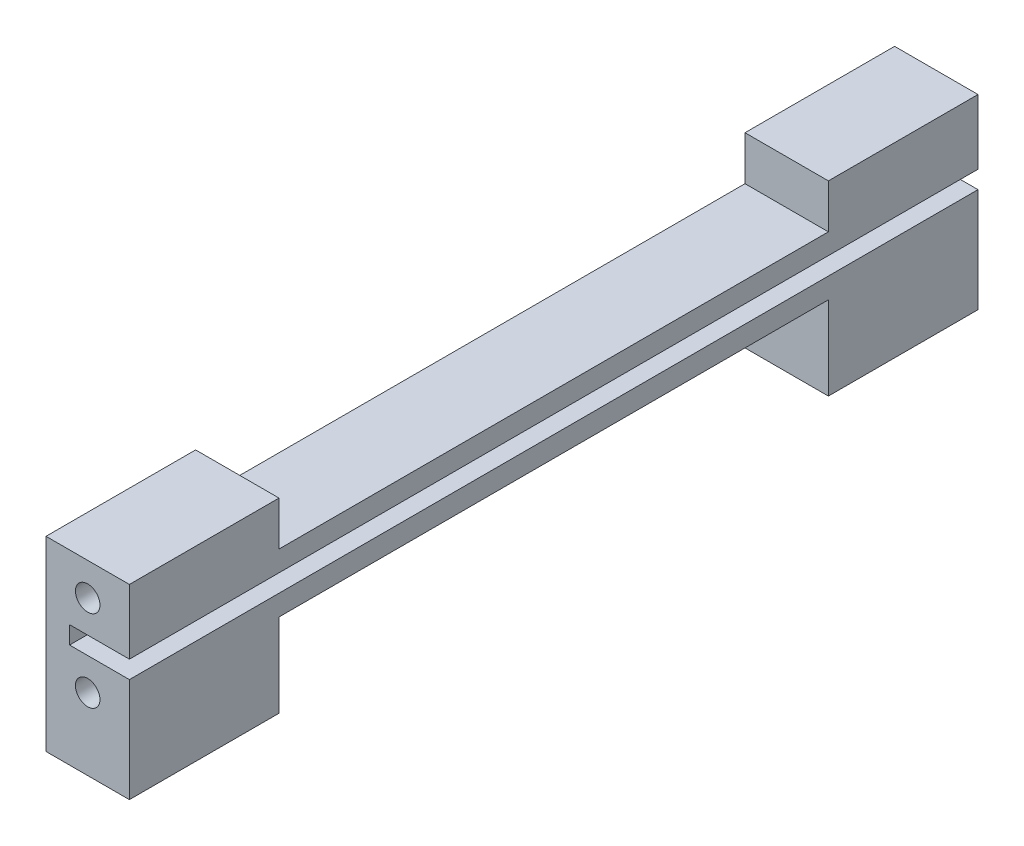
ISO-10303-21;
HEADER;
FILE_DESCRIPTION(('STEP AP214'),'2;1');
FILE_NAME('part.step','',(''),(''),'','','');
FILE_SCHEMA(('AUTOMOTIVE_DESIGN { 1 0 10303 214 1 1 1 1 }'));
ENDSEC;
DATA;
#1=APPLICATION_CONTEXT('core data for automotive mechanical design processes');
#2=APPLICATION_PROTOCOL_DEFINITION('international standard','automotive_design',2000,#1);
#3=PRODUCT_CONTEXT('',#1,'mechanical');
#4=PRODUCT('Part','Part','',(#3));
#5=PRODUCT_RELATED_PRODUCT_CATEGORY('part','',(#4));
#6=PRODUCT_DEFINITION_FORMATION('','',#4);
#7=PRODUCT_DEFINITION_CONTEXT('part definition',#1,'design');
#8=PRODUCT_DEFINITION('design','',#6,#7);
#9=PRODUCT_DEFINITION_SHAPE('','',#8);
#10=(LENGTH_UNIT() NAMED_UNIT(*) SI_UNIT(.MILLI.,.METRE.));
#11=(NAMED_UNIT(*) PLANE_ANGLE_UNIT() SI_UNIT($,.RADIAN.));
#12=(NAMED_UNIT(*) SI_UNIT($,.STERADIAN.) SOLID_ANGLE_UNIT());
#13=UNCERTAINTY_MEASURE_WITH_UNIT(LENGTH_MEASURE(1.E-05),#10,'distance_accuracy_value','');
#14=(GEOMETRIC_REPRESENTATION_CONTEXT(3) GLOBAL_UNCERTAINTY_ASSIGNED_CONTEXT((#13)) GLOBAL_UNIT_ASSIGNED_CONTEXT((#10,
#11,#12)) REPRESENTATION_CONTEXT('',''));
#15=CARTESIAN_POINT('',(0.,0.,0.));
#16=DIRECTION('',(0.,0.,1.));
#17=DIRECTION('',(1.,0.,0.));
#18=AXIS2_PLACEMENT_3D('',#15,#16,#17);
#19=CARTESIAN_POINT('',(8.5,0.,0.));
#20=DIRECTION('',(-1.,0.,0.));
#21=DIRECTION('',(0.,0.,1.));
#22=AXIS2_PLACEMENT_3D('',#19,#20,#21);
#23=PLANE('',#22);
#24=DIRECTION('',(0.,0.,-1.));
#25=VECTOR('',#24,1.);
#26=CARTESIAN_POINT('',(8.5,6.6,0.));
#27=LINE('',#26,#25);
#28=CARTESIAN_POINT('',(8.5,6.6,0.));
#29=VERTEX_POINT('',#28);
#30=CARTESIAN_POINT('',(8.5,6.6,-86.5));
#31=VERTEX_POINT('',#30);
#32=EDGE_CURVE('E322',#29,#31,#27,.T.);
#33=ORIENTED_EDGE('',*,*,#32,.F.);
#34=DIRECTION('',(0.,-1.,0.));
#35=VECTOR('',#34,1.);
#36=CARTESIAN_POINT('',(8.5,15.,0.));
#37=LINE('',#36,#35);
#38=CARTESIAN_POINT('',(8.5,-4.,0.));
#39=VERTEX_POINT('',#38);
#40=EDGE_CURVE('E240',#29,#39,#37,.T.);
#41=ORIENTED_EDGE('',*,*,#40,.T.);
#42=DIRECTION('',(0.,0.,1.));
#43=VECTOR('',#42,1.);
#44=CARTESIAN_POINT('',(8.5,-4.,0.));
#45=LINE('',#44,#43);
#46=CARTESIAN_POINT('',(8.5,-4.,-15.25));
#47=VERTEX_POINT('',#46);
#48=EDGE_CURVE('E289',#47,#39,#45,.T.);
#49=ORIENTED_EDGE('',*,*,#48,.F.);
#50=DIRECTION('',(0.,1.,0.));
#51=VECTOR('',#50,1.);
#52=CARTESIAN_POINT('',(8.5,0.,-15.25));
#53=LINE('',#52,#51);
#54=CARTESIAN_POINT('',(8.5,4.5,-15.25));
#55=VERTEX_POINT('',#54);
#56=EDGE_CURVE('E127',#47,#55,#53,.T.);
#57=ORIENTED_EDGE('',*,*,#56,.T.);
#58=DIRECTION('',(0.,0.,-1.));
#59=VECTOR('',#58,1.);
#60=CARTESIAN_POINT('',(8.5,4.5,-15.25));
#61=LINE('',#60,#59);
#62=CARTESIAN_POINT('',(8.5,4.5,-71.25));
#63=VERTEX_POINT('',#62);
#64=EDGE_CURVE('E117',#55,#63,#61,.T.);
#65=ORIENTED_EDGE('',*,*,#64,.T.);
#66=DIRECTION('',(0.,-1.,0.));
#67=VECTOR('',#66,1.);
#68=CARTESIAN_POINT('',(8.5,4.5,-71.25));
#69=LINE('',#68,#67);
#70=CARTESIAN_POINT('',(8.5,-4.,-71.25));
#71=VERTEX_POINT('',#70);
#72=EDGE_CURVE('E123',#63,#71,#69,.T.);
#73=ORIENTED_EDGE('',*,*,#72,.T.);
#74=DIRECTION('',(0.,0.,1.));
#75=VECTOR('',#74,1.);
#76=CARTESIAN_POINT('',(8.5,-4.,-86.5));
#77=LINE('',#76,#75);
#78=CARTESIAN_POINT('',(8.5,-4.,-86.5));
#79=VERTEX_POINT('',#78);
#80=EDGE_CURVE('E303',#79,#71,#77,.T.);
#81=ORIENTED_EDGE('',*,*,#80,.F.);
#82=DIRECTION('',(0.,1.,0.));
#83=VECTOR('',#82,1.);
#84=CARTESIAN_POINT('',(8.5,0.,-86.5));
#85=LINE('',#84,#83);
#86=EDGE_CURVE('E153',#79,#31,#85,.T.);
#87=ORIENTED_EDGE('',*,*,#86,.T.);
#88=EDGE_LOOP('',(#33,#41,#49,#57,#65,#73,#81,#87));
#89=FACE_BOUND('',#88,.T.);
#90=ADVANCED_FACE('F38',(#89),#23,.F.);
#91=CARTESIAN_POINT('',(8.5,15.,0.));
#92=DIRECTION('',(0.,0.,-1.));
#93=DIRECTION('',(0.,1.,0.));
#94=AXIS2_PLACEMENT_3D('',#91,#92,#93);
#95=PLANE('',#94);
#96=DIRECTION('',(0.,-1.,0.));
#97=VECTOR('',#96,1.);
#98=CARTESIAN_POINT('',(2.4,8.35,0.));
#99=LINE('',#98,#97);
#100=CARTESIAN_POINT('',(2.4,8.4,0.));
#101=VERTEX_POINT('',#100);
#102=CARTESIAN_POINT('',(2.4,6.6,0.));
#103=VERTEX_POINT('',#102);
#104=EDGE_CURVE('E330',#101,#103,#99,.T.);
#105=ORIENTED_EDGE('',*,*,#104,.F.);
#106=DIRECTION('',(-1.,0.,0.));
#107=VECTOR('',#106,1.);
#108=CARTESIAN_POINT('',(8.5,8.4,0.));
#109=LINE('',#108,#107);
#110=CARTESIAN_POINT('',(8.5,8.4,0.));
#111=VERTEX_POINT('',#110);
#112=EDGE_CURVE('E237',#111,#101,#109,.T.);
#113=ORIENTED_EDGE('',*,*,#112,.F.);
#114=CARTESIAN_POINT('',(8.5,15.,0.));
#115=VERTEX_POINT('',#114);
#116=EDGE_CURVE('E234',#115,#111,#37,.T.);
#117=ORIENTED_EDGE('',*,*,#116,.F.);
#118=DIRECTION('',(-1.,0.,0.));
#119=VECTOR('',#118,1.);
#120=CARTESIAN_POINT('',(8.5,15.,0.));
#121=LINE('',#120,#119);
#122=CARTESIAN_POINT('',(0.,15.,0.));
#123=VERTEX_POINT('',#122);
#124=EDGE_CURVE('E199',#115,#123,#121,.T.);
#125=ORIENTED_EDGE('',*,*,#124,.T.);
#126=DIRECTION('',(0.,-1.,0.));
#127=VECTOR('',#126,1.);
#128=CARTESIAN_POINT('',(0.,15.,0.));
#129=LINE('',#128,#127);
#130=CARTESIAN_POINT('',(0.,-4.,0.));
#131=VERTEX_POINT('',#130);
#132=EDGE_CURVE('E176',#123,#131,#129,.T.);
#133=ORIENTED_EDGE('',*,*,#132,.T.);
#134=DIRECTION('',(-1.,0.,0.));
#135=VECTOR('',#134,1.);
#136=CARTESIAN_POINT('',(0.,-4.,0.));
#137=LINE('',#136,#135);
#138=EDGE_CURVE('E286',#39,#131,#137,.T.);
#139=ORIENTED_EDGE('',*,*,#138,.F.);
#140=ORIENTED_EDGE('',*,*,#40,.F.);
#141=DIRECTION('',(1.,0.,0.));
#142=VECTOR('',#141,1.);
#143=CARTESIAN_POINT('',(8.5,6.6,0.));
#144=LINE('',#143,#142);
#145=EDGE_CURVE('E314',#103,#29,#144,.T.);
#146=ORIENTED_EDGE('',*,*,#145,.F.);
#147=EDGE_LOOP('',(#105,#113,#117,#125,#133,#139,#140,#146));
#148=FACE_BOUND('',#147,.T.);
#149=CARTESIAN_POINT('',(4.25,3.325,0.));
#150=DIRECTION('',(0.,0.,1.));
#151=DIRECTION('',(1.,0.,0.));
#152=AXIS2_PLACEMENT_3D('',#149,#150,#151);
#153=CIRCLE('',#152,1.24999999999999);
#154=CARTESIAN_POINT('',(5.49999999999999,3.325,0.));
#155=VERTEX_POINT('',#154);
#156=EDGE_CURVE('E266',#155,#155,#153,.T.);
#157=ORIENTED_EDGE('',*,*,#156,.F.);
#158=EDGE_LOOP('',(#157));
#159=FACE_BOUND('',#158,.T.);
#160=CARTESIAN_POINT('',(4.25,11.675,0.));
#161=DIRECTION('',(0.,0.,1.));
#162=DIRECTION('',(1.,0.,0.));
#163=AXIS2_PLACEMENT_3D('',#160,#161,#162);
#164=CIRCLE('',#163,1.24999999999999);
#165=CARTESIAN_POINT('',(5.49999999999999,11.675,0.));
#166=VERTEX_POINT('',#165);
#167=EDGE_CURVE('E258',#166,#166,#164,.T.);
#168=ORIENTED_EDGE('',*,*,#167,.F.);
#169=EDGE_LOOP('',(#168));
#170=FACE_BOUND('',#169,.T.);
#171=ADVANCED_FACE('F227',(#148,#159,#170),#95,.F.);
#172=CARTESIAN_POINT('',(8.5,0.,-86.5));
#173=DIRECTION('',(0.,0.,1.));
#174=DIRECTION('',(0.,-1.,0.));
#175=AXIS2_PLACEMENT_3D('',#172,#173,#174);
#176=PLANE('',#175);
#177=CARTESIAN_POINT('',(4.25,3.32499999999998,-86.5));
#178=DIRECTION('',(0.,0.,-1.));
#179=DIRECTION('',(0.,1.,0.));
#180=AXIS2_PLACEMENT_3D('',#177,#178,#179);
#181=CIRCLE('',#180,1.24999999999999);
#182=CARTESIAN_POINT('',(4.25,4.57499999999997,-86.5));
#183=VERTEX_POINT('',#182);
#184=EDGE_CURVE('E282',#183,#183,#181,.T.);
#185=ORIENTED_EDGE('',*,*,#184,.F.);
#186=EDGE_LOOP('',(#185));
#187=FACE_BOUND('',#186,.T.);
#188=CARTESIAN_POINT('',(4.25,11.675,-86.5));
#189=DIRECTION('',(0.,0.,-1.));
#190=DIRECTION('',(0.,1.,0.));
#191=AXIS2_PLACEMENT_3D('',#188,#189,#190);
#192=CIRCLE('',#191,1.24999999999999);
#193=CARTESIAN_POINT('',(4.25,12.925,-86.5));
#194=VERTEX_POINT('',#193);
#195=EDGE_CURVE('E274',#194,#194,#192,.T.);
#196=ORIENTED_EDGE('',*,*,#195,.F.);
#197=EDGE_LOOP('',(#196));
#198=FACE_BOUND('',#197,.T.);
#199=DIRECTION('',(1.,0.,0.));
#200=VECTOR('',#199,1.);
#201=CARTESIAN_POINT('',(8.5,8.4,-86.5));
#202=LINE('',#201,#200);
#203=CARTESIAN_POINT('',(2.4,8.4,-86.5));
#204=VERTEX_POINT('',#203);
#205=CARTESIAN_POINT('',(8.5,8.4,-86.5));
#206=VERTEX_POINT('',#205);
#207=EDGE_CURVE('E338',#204,#206,#202,.T.);
#208=ORIENTED_EDGE('',*,*,#207,.F.);
#209=DIRECTION('',(0.,1.,0.));
#210=VECTOR('',#209,1.);
#211=CARTESIAN_POINT('',(2.4,8.35,-86.5));
#212=LINE('',#211,#210);
#213=CARTESIAN_POINT('',(2.4,6.6,-86.5));
#214=VERTEX_POINT('',#213);
#215=EDGE_CURVE('E334',#214,#204,#212,.T.);
#216=ORIENTED_EDGE('',*,*,#215,.F.);
#217=DIRECTION('',(-1.,0.,0.));
#218=VECTOR('',#217,1.);
#219=CARTESIAN_POINT('',(8.5,6.6,-86.5));
#220=LINE('',#219,#218);
#221=EDGE_CURVE('E318',#31,#214,#220,.T.);
#222=ORIENTED_EDGE('',*,*,#221,.F.);
#223=ORIENTED_EDGE('',*,*,#86,.F.);
#224=DIRECTION('',(1.,0.,0.));
#225=VECTOR('',#224,1.);
#226=CARTESIAN_POINT('',(0.,-4.,-86.5));
#227=LINE('',#226,#225);
#228=CARTESIAN_POINT('',(0.,-4.,-86.5));
#229=VERTEX_POINT('',#228);
#230=EDGE_CURVE('E306',#229,#79,#227,.T.);
#231=ORIENTED_EDGE('',*,*,#230,.F.);
#232=DIRECTION('',(0.,1.,0.));
#233=VECTOR('',#232,1.);
#234=CARTESIAN_POINT('',(0.,0.,-86.5));
#235=LINE('',#234,#233);
#236=CARTESIAN_POINT('',(0.,15.,-86.5));
#237=VERTEX_POINT('',#236);
#238=EDGE_CURVE('E86',#229,#237,#235,.T.);
#239=ORIENTED_EDGE('',*,*,#238,.T.);
#240=DIRECTION('',(-1.,0.,0.));
#241=VECTOR('',#240,1.);
#242=CARTESIAN_POINT('',(8.5,15.,-86.5));
#243=LINE('',#242,#241);
#244=CARTESIAN_POINT('',(8.5,15.,-86.5));
#245=VERTEX_POINT('',#244);
#246=EDGE_CURVE('E143',#245,#237,#243,.T.);
#247=ORIENTED_EDGE('',*,*,#246,.F.);
#248=EDGE_CURVE('E150',#206,#245,#85,.T.);
#249=ORIENTED_EDGE('',*,*,#248,.F.);
#250=EDGE_LOOP('',(#208,#216,#222,#223,#231,#239,#247,#249));
#251=FACE_BOUND('',#250,.T.);
#252=ADVANCED_FACE('F362',(#187,#198,#251),#176,.F.);
#253=ORIENTED_EDGE('',*,*,#116,.T.);
#254=DIRECTION('',(0.,0.,1.));
#255=VECTOR('',#254,1.);
#256=CARTESIAN_POINT('',(8.5,8.4,0.));
#257=LINE('',#256,#255);
#258=EDGE_CURVE('E348',#206,#111,#257,.T.);
#259=ORIENTED_EDGE('',*,*,#258,.F.);
#260=ORIENTED_EDGE('',*,*,#248,.T.);
#261=DIRECTION('',(0.,0.,1.));
#262=VECTOR('',#261,1.);
#263=CARTESIAN_POINT('',(8.5,15.,-86.5));
#264=LINE('',#263,#262);
#265=CARTESIAN_POINT('',(8.5,15.,-71.25));
#266=VERTEX_POINT('',#265);
#267=EDGE_CURVE('E56',#245,#266,#264,.T.);
#268=ORIENTED_EDGE('',*,*,#267,.T.);
#269=DIRECTION('',(0.,-1.,0.));
#270=VECTOR('',#269,1.);
#271=CARTESIAN_POINT('',(8.5,15.,-71.25));
#272=LINE('',#271,#270);
#273=CARTESIAN_POINT('',(8.5,10.5,-71.25));
#274=VERTEX_POINT('',#273);
#275=EDGE_CURVE('E192',#266,#274,#272,.T.);
#276=ORIENTED_EDGE('',*,*,#275,.T.);
#277=DIRECTION('',(0.,0.,1.));
#278=VECTOR('',#277,1.);
#279=CARTESIAN_POINT('',(8.5,10.5,-71.25));
#280=LINE('',#279,#278);
#281=CARTESIAN_POINT('',(8.5,10.5,-15.25));
#282=VERTEX_POINT('',#281);
#283=EDGE_CURVE('E100',#274,#282,#280,.T.);
#284=ORIENTED_EDGE('',*,*,#283,.T.);
#285=DIRECTION('',(0.,1.,0.));
#286=VECTOR('',#285,1.);
#287=CARTESIAN_POINT('',(8.5,10.5,-15.25));
#288=LINE('',#287,#286);
#289=CARTESIAN_POINT('',(8.5,15.,-15.25));
#290=VERTEX_POINT('',#289);
#291=EDGE_CURVE('E213',#282,#290,#288,.T.);
#292=ORIENTED_EDGE('',*,*,#291,.T.);
#293=DIRECTION('',(0.,0.,1.));
#294=VECTOR('',#293,1.);
#295=CARTESIAN_POINT('',(8.5,15.,-15.25));
#296=LINE('',#295,#294);
#297=EDGE_CURVE('E245',#290,#115,#296,.T.);
#298=ORIENTED_EDGE('',*,*,#297,.T.);
#299=EDGE_LOOP('',(#253,#259,#260,#268,#276,#284,#292,#298));
#300=FACE_BOUND('',#299,.T.);
#301=ADVANCED_FACE('F358',(#300),#23,.F.);
#302=CARTESIAN_POINT('',(8.5,15.,-71.25));
#303=DIRECTION('',(0.,0.,-1.));
#304=DIRECTION('',(-1.,0.,0.));
#305=AXIS2_PLACEMENT_3D('',#302,#303,#304);
#306=PLANE('',#305);
#307=DIRECTION('',(0.,-1.,0.));
#308=VECTOR('',#307,1.);
#309=CARTESIAN_POINT('',(0.,15.,-71.25));
#310=LINE('',#309,#308);
#311=CARTESIAN_POINT('',(0.,15.,-71.25));
#312=VERTEX_POINT('',#311);
#313=CARTESIAN_POINT('',(0.,10.5,-71.25));
#314=VERTEX_POINT('',#313);
#315=EDGE_CURVE('E162',#312,#314,#310,.T.);
#316=ORIENTED_EDGE('',*,*,#315,.T.);
#317=DIRECTION('',(-1.,0.,0.));
#318=VECTOR('',#317,1.);
#319=CARTESIAN_POINT('',(8.5,10.5,-71.25));
#320=LINE('',#319,#318);
#321=EDGE_CURVE('E11',#274,#314,#320,.T.);
#322=ORIENTED_EDGE('',*,*,#321,.F.);
#323=ORIENTED_EDGE('',*,*,#275,.F.);
#324=DIRECTION('',(-1.,0.,0.));
#325=VECTOR('',#324,1.);
#326=CARTESIAN_POINT('',(8.5,15.,-71.25));
#327=LINE('',#326,#325);
#328=EDGE_CURVE('E161',#266,#312,#327,.T.);
#329=ORIENTED_EDGE('',*,*,#328,.T.);
#330=EDGE_LOOP('',(#316,#322,#323,#329));
#331=FACE_BOUND('',#330,.T.);
#332=ADVANCED_FACE('F40',(#331),#306,.F.);
#333=CARTESIAN_POINT('',(8.5,10.5,-71.25));
#334=DIRECTION('',(0.,-1.,0.));
#335=DIRECTION('',(0.,0.,-1.));
#336=AXIS2_PLACEMENT_3D('',#333,#334,#335);
#337=PLANE('',#336);
#338=DIRECTION('',(0.,0.,1.));
#339=VECTOR('',#338,1.);
#340=CARTESIAN_POINT('',(0.,10.5,-71.25));
#341=LINE('',#340,#339);
#342=CARTESIAN_POINT('',(0.,10.5,-15.25));
#343=VERTEX_POINT('',#342);
#344=EDGE_CURVE('E166',#314,#343,#341,.T.);
#345=ORIENTED_EDGE('',*,*,#344,.T.);
#346=DIRECTION('',(-1.,0.,0.));
#347=VECTOR('',#346,1.);
#348=CARTESIAN_POINT('',(8.5,10.5,-15.25));
#349=LINE('',#348,#347);
#350=EDGE_CURVE('E48',#282,#343,#349,.T.);
#351=ORIENTED_EDGE('',*,*,#350,.F.);
#352=ORIENTED_EDGE('',*,*,#283,.F.);
#353=ORIENTED_EDGE('',*,*,#321,.T.);
#354=EDGE_LOOP('',(#345,#351,#352,#353));
#355=FACE_BOUND('',#354,.T.);
#356=ADVANCED_FACE('F368',(#355),#337,.F.);
#357=CARTESIAN_POINT('',(8.5,10.5,-15.25));
#358=DIRECTION('',(0.,0.,1.));
#359=DIRECTION('',(0.,-1.,0.));
#360=AXIS2_PLACEMENT_3D('',#357,#358,#359);
#361=PLANE('',#360);
#362=DIRECTION('',(0.,1.,0.));
#363=VECTOR('',#362,1.);
#364=CARTESIAN_POINT('',(0.,10.5,-15.25));
#365=LINE('',#364,#363);
#366=CARTESIAN_POINT('',(0.,15.,-15.25));
#367=VERTEX_POINT('',#366);
#368=EDGE_CURVE('E170',#343,#367,#365,.T.);
#369=ORIENTED_EDGE('',*,*,#368,.T.);
#370=DIRECTION('',(-1.,0.,0.));
#371=VECTOR('',#370,1.);
#372=CARTESIAN_POINT('',(8.5,15.,-15.25));
#373=LINE('',#372,#371);
#374=EDGE_CURVE('E203',#290,#367,#373,.T.);
#375=ORIENTED_EDGE('',*,*,#374,.F.);
#376=ORIENTED_EDGE('',*,*,#291,.F.);
#377=ORIENTED_EDGE('',*,*,#350,.T.);
#378=EDGE_LOOP('',(#369,#375,#376,#377));
#379=FACE_BOUND('',#378,.T.);
#380=ADVANCED_FACE('F211',(#379),#361,.F.);
#381=CARTESIAN_POINT('',(8.5,15.,-15.25));
#382=DIRECTION('',(0.,-1.,0.));
#383=DIRECTION('',(0.,0.,-1.));
#384=AXIS2_PLACEMENT_3D('',#381,#382,#383);
#385=PLANE('',#384);
#386=DIRECTION('',(0.,0.,1.));
#387=VECTOR('',#386,1.);
#388=CARTESIAN_POINT('',(0.,15.,-15.25));
#389=LINE('',#388,#387);
#390=EDGE_CURVE('E173',#367,#123,#389,.T.);
#391=ORIENTED_EDGE('',*,*,#390,.T.);
#392=ORIENTED_EDGE('',*,*,#124,.F.);
#393=ORIENTED_EDGE('',*,*,#297,.F.);
#394=ORIENTED_EDGE('',*,*,#374,.T.);
#395=EDGE_LOOP('',(#391,#392,#393,#394));
#396=FACE_BOUND('',#395,.T.);
#397=ADVANCED_FACE('F222',(#396),#385,.F.);
#398=CARTESIAN_POINT('',(8.5,0.,-15.25));
#399=DIRECTION('',(0.,0.,1.));
#400=DIRECTION('',(1.,0.,0.));
#401=AXIS2_PLACEMENT_3D('',#398,#399,#400);
#402=PLANE('',#401);
#403=DIRECTION('',(0.,1.,0.));
#404=VECTOR('',#403,1.);
#405=CARTESIAN_POINT('',(0.,0.,-15.25));
#406=LINE('',#405,#404);
#407=CARTESIAN_POINT('',(0.,-4.,-15.25));
#408=VERTEX_POINT('',#407);
#409=CARTESIAN_POINT('',(0.,4.5,-15.25));
#410=VERTEX_POINT('',#409);
#411=EDGE_CURVE('E180',#408,#410,#406,.T.);
#412=ORIENTED_EDGE('',*,*,#411,.T.);
#413=DIRECTION('',(-1.,0.,0.));
#414=VECTOR('',#413,1.);
#415=CARTESIAN_POINT('',(8.5,4.5,-15.25));
#416=LINE('',#415,#414);
#417=EDGE_CURVE('E142',#55,#410,#416,.T.);
#418=ORIENTED_EDGE('',*,*,#417,.F.);
#419=ORIENTED_EDGE('',*,*,#56,.F.);
#420=DIRECTION('',(1.,0.,0.));
#421=VECTOR('',#420,1.);
#422=CARTESIAN_POINT('',(0.,-4.,-15.25));
#423=LINE('',#422,#421);
#424=EDGE_CURVE('E293',#408,#47,#423,.T.);
#425=ORIENTED_EDGE('',*,*,#424,.F.);
#426=EDGE_LOOP('',(#412,#418,#419,#425));
#427=FACE_BOUND('',#426,.T.);
#428=ADVANCED_FACE('F402',(#427),#402,.F.);
#429=CARTESIAN_POINT('',(8.5,4.5,-15.25));
#430=DIRECTION('',(0.,1.,0.));
#431=DIRECTION('',(0.,0.,1.));
#432=AXIS2_PLACEMENT_3D('',#429,#430,#431);
#433=PLANE('',#432);
#434=DIRECTION('',(0.,0.,-1.));
#435=VECTOR('',#434,1.);
#436=CARTESIAN_POINT('',(0.,4.5,-15.25));
#437=LINE('',#436,#435);
#438=CARTESIAN_POINT('',(0.,4.5,-71.25));
#439=VERTEX_POINT('',#438);
#440=EDGE_CURVE('E137',#410,#439,#437,.T.);
#441=ORIENTED_EDGE('',*,*,#440,.T.);
#442=DIRECTION('',(-1.,0.,0.));
#443=VECTOR('',#442,1.);
#444=CARTESIAN_POINT('',(8.5,4.5,-71.25));
#445=LINE('',#444,#443);
#446=EDGE_CURVE('E134',#63,#439,#445,.T.);
#447=ORIENTED_EDGE('',*,*,#446,.F.);
#448=ORIENTED_EDGE('',*,*,#64,.F.);
#449=ORIENTED_EDGE('',*,*,#417,.T.);
#450=EDGE_LOOP('',(#441,#447,#448,#449));
#451=FACE_BOUND('',#450,.T.);
#452=ADVANCED_FACE('F135',(#451),#433,.F.);
#453=CARTESIAN_POINT('',(8.5,4.5,-71.25));
#454=DIRECTION('',(0.,0.,-1.));
#455=DIRECTION('',(-1.,0.,0.));
#456=AXIS2_PLACEMENT_3D('',#453,#454,#455);
#457=PLANE('',#456);
#458=DIRECTION('',(0.,-1.,0.));
#459=VECTOR('',#458,1.);
#460=CARTESIAN_POINT('',(0.,4.5,-71.25));
#461=LINE('',#460,#459);
#462=CARTESIAN_POINT('',(0.,-4.,-71.25));
#463=VERTEX_POINT('',#462);
#464=EDGE_CURVE('E185',#439,#463,#461,.T.);
#465=ORIENTED_EDGE('',*,*,#464,.T.);
#466=DIRECTION('',(-1.,0.,0.));
#467=VECTOR('',#466,1.);
#468=CARTESIAN_POINT('',(0.,-4.,-71.25));
#469=LINE('',#468,#467);
#470=EDGE_CURVE('E148',#71,#463,#469,.T.);
#471=ORIENTED_EDGE('',*,*,#470,.F.);
#472=ORIENTED_EDGE('',*,*,#72,.F.);
#473=ORIENTED_EDGE('',*,*,#446,.T.);
#474=EDGE_LOOP('',(#465,#471,#472,#473));
#475=FACE_BOUND('',#474,.T.);
#476=ADVANCED_FACE('F146',(#475),#457,.F.);
#477=CARTESIAN_POINT('',(8.5,15.,-86.5));
#478=DIRECTION('',(0.,-1.,0.));
#479=DIRECTION('',(0.,0.,-1.));
#480=AXIS2_PLACEMENT_3D('',#477,#478,#479);
#481=PLANE('',#480);
#482=DIRECTION('',(0.,0.,1.));
#483=VECTOR('',#482,1.);
#484=CARTESIAN_POINT('',(0.,15.,-86.5));
#485=LINE('',#484,#483);
#486=EDGE_CURVE('E92',#237,#312,#485,.T.);
#487=ORIENTED_EDGE('',*,*,#486,.T.);
#488=ORIENTED_EDGE('',*,*,#328,.F.);
#489=ORIENTED_EDGE('',*,*,#267,.F.);
#490=ORIENTED_EDGE('',*,*,#246,.T.);
#491=EDGE_LOOP('',(#487,#488,#489,#490));
#492=FACE_BOUND('',#491,.T.);
#493=ADVANCED_FACE('F364',(#492),#481,.F.);
#494=CARTESIAN_POINT('',(0.,0.,0.));
#495=DIRECTION('',(-1.,0.,0.));
#496=DIRECTION('',(0.,0.,1.));
#497=AXIS2_PLACEMENT_3D('',#494,#495,#496);
#498=PLANE('',#497);
#499=ORIENTED_EDGE('',*,*,#315,.F.);
#500=ORIENTED_EDGE('',*,*,#486,.F.);
#501=ORIENTED_EDGE('',*,*,#238,.F.);
#502=DIRECTION('',(0.,0.,-1.));
#503=VECTOR('',#502,1.);
#504=CARTESIAN_POINT('',(0.,-4.,-86.5));
#505=LINE('',#504,#503);
#506=EDGE_CURVE('E310',#463,#229,#505,.T.);
#507=ORIENTED_EDGE('',*,*,#506,.F.);
#508=ORIENTED_EDGE('',*,*,#464,.F.);
#509=ORIENTED_EDGE('',*,*,#440,.F.);
#510=ORIENTED_EDGE('',*,*,#411,.F.);
#511=DIRECTION('',(0.,0.,-1.));
#512=VECTOR('',#511,1.);
#513=CARTESIAN_POINT('',(0.,-4.,0.));
#514=LINE('',#513,#512);
#515=EDGE_CURVE('E297',#131,#408,#514,.T.);
#516=ORIENTED_EDGE('',*,*,#515,.F.);
#517=ORIENTED_EDGE('',*,*,#132,.F.);
#518=ORIENTED_EDGE('',*,*,#390,.F.);
#519=ORIENTED_EDGE('',*,*,#368,.F.);
#520=ORIENTED_EDGE('',*,*,#344,.F.);
#521=EDGE_LOOP('',(#499,#500,#501,#507,#508,#509,#510,#516,#517,#518,#519,#520));
#522=FACE_BOUND('',#521,.T.);
#523=ADVANCED_FACE('F217',(#522),#498,.T.);
#524=CARTESIAN_POINT('',(4.25,11.675,-6.));
#525=DIRECTION('',(0.,0.,1.));
#526=DIRECTION('',(1.,0.,0.));
#527=AXIS2_PLACEMENT_3D('',#524,#525,#526);
#528=CONICAL_SURFACE('',#527,1.25,1.02974425867665);
#529=CARTESIAN_POINT('',(4.25,11.675,-6.75107577378445));
#530=VERTEX_POINT('',#529);
#531=VERTEX_LOOP('',#530);
#532=FACE_BOUND('',#531,.T.);
#533=CARTESIAN_POINT('',(4.25,11.675,-6.));
#534=DIRECTION('',(0.,0.,1.));
#535=DIRECTION('',(1.,0.,0.));
#536=AXIS2_PLACEMENT_3D('',#533,#534,#535);
#537=CIRCLE('',#536,1.25);
#538=CARTESIAN_POINT('',(5.5,11.675,-6.));
#539=VERTEX_POINT('',#538);
#540=EDGE_CURVE('E167',#539,#539,#537,.T.);
#541=ORIENTED_EDGE('',*,*,#540,.T.);
#542=EDGE_LOOP('',(#541));
#543=FACE_BOUND('',#542,.T.);
#544=ADVANCED_FACE('F424',(#532,#543),#528,.F.);
#545=CARTESIAN_POINT('',(4.25,11.675,0.));
#546=DIRECTION('',(0.,0.,1.));
#547=DIRECTION('',(1.,0.,0.));
#548=AXIS2_PLACEMENT_3D('',#545,#546,#547);
#549=CYLINDRICAL_SURFACE('',#548,1.24999999999999);
#550=ORIENTED_EDGE('',*,*,#540,.F.);
#551=EDGE_LOOP('',(#550));
#552=FACE_BOUND('',#551,.T.);
#553=ORIENTED_EDGE('',*,*,#167,.T.);
#554=EDGE_LOOP('',(#553));
#555=FACE_BOUND('',#554,.T.);
#556=ADVANCED_FACE('F427',(#552,#555),#549,.F.);
#557=CARTESIAN_POINT('',(4.25,3.325,-6.));
#558=DIRECTION('',(0.,0.,1.));
#559=DIRECTION('',(1.,0.,0.));
#560=AXIS2_PLACEMENT_3D('',#557,#558,#559);
#561=CONICAL_SURFACE('',#560,1.25,1.02974425867665);
#562=CARTESIAN_POINT('',(4.25,3.325,-6.75107577378445));
#563=VERTEX_POINT('',#562);
#564=VERTEX_LOOP('',#563);
#565=FACE_BOUND('',#564,.T.);
#566=CARTESIAN_POINT('',(4.25,3.325,-6.));
#567=DIRECTION('',(0.,0.,1.));
#568=DIRECTION('',(1.,0.,0.));
#569=AXIS2_PLACEMENT_3D('',#566,#567,#568);
#570=CIRCLE('',#569,1.25);
#571=CARTESIAN_POINT('',(5.5,3.325,-6.));
#572=VERTEX_POINT('',#571);
#573=EDGE_CURVE('E262',#572,#572,#570,.T.);
#574=ORIENTED_EDGE('',*,*,#573,.T.);
#575=EDGE_LOOP('',(#574));
#576=FACE_BOUND('',#575,.T.);
#577=ADVANCED_FACE('F434',(#565,#576),#561,.F.);
#578=CARTESIAN_POINT('',(4.25,3.325,0.));
#579=DIRECTION('',(0.,0.,1.));
#580=DIRECTION('',(1.,0.,0.));
#581=AXIS2_PLACEMENT_3D('',#578,#579,#580);
#582=CYLINDRICAL_SURFACE('',#581,1.24999999999999);
#583=ORIENTED_EDGE('',*,*,#573,.F.);
#584=EDGE_LOOP('',(#583));
#585=FACE_BOUND('',#584,.T.);
#586=ORIENTED_EDGE('',*,*,#156,.T.);
#587=EDGE_LOOP('',(#586));
#588=FACE_BOUND('',#587,.T.);
#589=ADVANCED_FACE('F442',(#585,#588),#582,.F.);
#590=CARTESIAN_POINT('',(4.25,11.675,-80.5));
#591=DIRECTION('',(0.,0.,-1.));
#592=DIRECTION('',(0.,1.,0.));
#593=AXIS2_PLACEMENT_3D('',#590,#591,#592);
#594=CONICAL_SURFACE('',#593,1.25,1.02974425867666);
#595=CARTESIAN_POINT('',(4.25,11.675,-79.7489242262156));
#596=VERTEX_POINT('',#595);
#597=VERTEX_LOOP('',#596);
#598=FACE_BOUND('',#597,.T.);
#599=CARTESIAN_POINT('',(4.25,11.675,-80.5));
#600=DIRECTION('',(0.,0.,-1.));
#601=DIRECTION('',(0.,1.,0.));
#602=AXIS2_PLACEMENT_3D('',#599,#600,#601);
#603=CIRCLE('',#602,1.25);
#604=CARTESIAN_POINT('',(4.25,12.925,-80.5));
#605=VERTEX_POINT('',#604);
#606=EDGE_CURVE('E270',#605,#605,#603,.T.);
#607=ORIENTED_EDGE('',*,*,#606,.T.);
#608=EDGE_LOOP('',(#607));
#609=FACE_BOUND('',#608,.T.);
#610=ADVANCED_FACE('F450',(#598,#609),#594,.F.);
#611=CARTESIAN_POINT('',(4.25,11.675,-86.5));
#612=DIRECTION('',(0.,0.,-1.));
#613=DIRECTION('',(0.,1.,0.));
#614=AXIS2_PLACEMENT_3D('',#611,#612,#613);
#615=CYLINDRICAL_SURFACE('',#614,1.24999999999999);
#616=ORIENTED_EDGE('',*,*,#606,.F.);
#617=EDGE_LOOP('',(#616));
#618=FACE_BOUND('',#617,.T.);
#619=ORIENTED_EDGE('',*,*,#195,.T.);
#620=EDGE_LOOP('',(#619));
#621=FACE_BOUND('',#620,.T.);
#622=ADVANCED_FACE('F458',(#618,#621),#615,.F.);
#623=CARTESIAN_POINT('',(4.25,3.32499999999998,-80.5));
#624=DIRECTION('',(0.,0.,-1.));
#625=DIRECTION('',(0.,1.,0.));
#626=AXIS2_PLACEMENT_3D('',#623,#624,#625);
#627=CONICAL_SURFACE('',#626,1.25,1.02974425867666);
#628=CARTESIAN_POINT('',(4.25,3.32499999999998,-79.7489242262156));
#629=VERTEX_POINT('',#628);
#630=VERTEX_LOOP('',#629);
#631=FACE_BOUND('',#630,.T.);
#632=CARTESIAN_POINT('',(4.25,3.32499999999998,-80.5));
#633=DIRECTION('',(0.,0.,-1.));
#634=DIRECTION('',(0.,1.,0.));
#635=AXIS2_PLACEMENT_3D('',#632,#633,#634);
#636=CIRCLE('',#635,1.25);
#637=CARTESIAN_POINT('',(4.25,4.57499999999998,-80.5));
#638=VERTEX_POINT('',#637);
#639=EDGE_CURVE('E278',#638,#638,#636,.T.);
#640=ORIENTED_EDGE('',*,*,#639,.T.);
#641=EDGE_LOOP('',(#640));
#642=FACE_BOUND('',#641,.T.);
#643=ADVANCED_FACE('F466',(#631,#642),#627,.F.);
#644=CARTESIAN_POINT('',(4.25,3.32499999999998,-86.5));
#645=DIRECTION('',(0.,0.,-1.));
#646=DIRECTION('',(0.,1.,0.));
#647=AXIS2_PLACEMENT_3D('',#644,#645,#646);
#648=CYLINDRICAL_SURFACE('',#647,1.24999999999999);
#649=ORIENTED_EDGE('',*,*,#639,.F.);
#650=EDGE_LOOP('',(#649));
#651=FACE_BOUND('',#650,.T.);
#652=ORIENTED_EDGE('',*,*,#184,.T.);
#653=EDGE_LOOP('',(#652));
#654=FACE_BOUND('',#653,.T.);
#655=ADVANCED_FACE('F474',(#651,#654),#648,.F.);
#656=CARTESIAN_POINT('',(0.,-4.,0.));
#657=DIRECTION('',(0.,-1.,0.));
#658=DIRECTION('',(0.,0.,-1.));
#659=AXIS2_PLACEMENT_3D('',#656,#657,#658);
#660=PLANE('',#659);
#661=ORIENTED_EDGE('',*,*,#515,.T.);
#662=ORIENTED_EDGE('',*,*,#424,.T.);
#663=ORIENTED_EDGE('',*,*,#48,.T.);
#664=ORIENTED_EDGE('',*,*,#138,.T.);
#665=EDGE_LOOP('',(#661,#662,#663,#664));
#666=FACE_BOUND('',#665,.T.);
#667=ADVANCED_FACE('F482',(#666),#660,.T.);
#668=CARTESIAN_POINT('',(0.,-4.,0.));
#669=DIRECTION('',(0.,1.,0.));
#670=DIRECTION('',(0.,0.,1.));
#671=AXIS2_PLACEMENT_3D('',#668,#669,#670);
#672=PLANE('',#671);
#673=ORIENTED_EDGE('',*,*,#506,.T.);
#674=ORIENTED_EDGE('',*,*,#230,.T.);
#675=ORIENTED_EDGE('',*,*,#80,.T.);
#676=ORIENTED_EDGE('',*,*,#470,.T.);
#677=EDGE_LOOP('',(#673,#674,#675,#676));
#678=FACE_BOUND('',#677,.T.);
#679=ADVANCED_FACE('F516',(#678),#672,.F.);
#680=CARTESIAN_POINT('',(0.,6.6,0.));
#681=DIRECTION('',(0.,1.,0.));
#682=DIRECTION('',(0.,0.,1.));
#683=AXIS2_PLACEMENT_3D('',#680,#681,#682);
#684=PLANE('',#683);
#685=ORIENTED_EDGE('',*,*,#32,.T.);
#686=ORIENTED_EDGE('',*,*,#221,.T.);
#687=DIRECTION('',(0.,0.,-1.));
#688=VECTOR('',#687,1.);
#689=CARTESIAN_POINT('',(2.4,6.6,-86.5));
#690=LINE('',#689,#688);
#691=EDGE_CURVE('E326',#103,#214,#690,.T.);
#692=ORIENTED_EDGE('',*,*,#691,.F.);
#693=ORIENTED_EDGE('',*,*,#145,.T.);
#694=EDGE_LOOP('',(#685,#686,#692,#693));
#695=FACE_BOUND('',#694,.T.);
#696=ADVANCED_FACE('F522',(#695),#684,.T.);
#697=CARTESIAN_POINT('',(2.4,0.,0.));
#698=DIRECTION('',(-1.,0.,0.));
#699=DIRECTION('',(0.,0.,1.));
#700=AXIS2_PLACEMENT_3D('',#697,#698,#699);
#701=PLANE('',#700);
#702=ORIENTED_EDGE('',*,*,#215,.T.);
#703=DIRECTION('',(0.,0.,-1.));
#704=VECTOR('',#703,1.);
#705=CARTESIAN_POINT('',(2.4,8.4,0.));
#706=LINE('',#705,#704);
#707=EDGE_CURVE('E342',#101,#204,#706,.T.);
#708=ORIENTED_EDGE('',*,*,#707,.F.);
#709=ORIENTED_EDGE('',*,*,#104,.T.);
#710=ORIENTED_EDGE('',*,*,#691,.T.);
#711=EDGE_LOOP('',(#702,#708,#709,#710));
#712=FACE_BOUND('',#711,.T.);
#713=ADVANCED_FACE('F535',(#712),#701,.F.);
#714=CARTESIAN_POINT('',(0.,8.4,0.));
#715=DIRECTION('',(0.,1.,0.));
#716=DIRECTION('',(0.,0.,1.));
#717=AXIS2_PLACEMENT_3D('',#714,#715,#716);
#718=PLANE('',#717);
#719=ORIENTED_EDGE('',*,*,#258,.T.);
#720=ORIENTED_EDGE('',*,*,#112,.T.);
#721=ORIENTED_EDGE('',*,*,#707,.T.);
#722=ORIENTED_EDGE('',*,*,#207,.T.);
#723=EDGE_LOOP('',(#719,#720,#721,#722));
#724=FACE_BOUND('',#723,.T.);
#725=ADVANCED_FACE('F352',(#724),#718,.F.);
#726=CLOSED_SHELL('',(#90,#171,#252,#301,#332,#356,#380,#397,#428,#452,#476,#493,#523,#544,#556,
#577,#589,#610,#622,#643,#655,#667,#679,#696,#713,#725));
#727=MANIFOLD_SOLID_BREP('B2',#726);
#728=ADVANCED_BREP_SHAPE_REPRESENTATION('',(#18,#727),#14);
#729=SHAPE_DEFINITION_REPRESENTATION(#9,#728);
ENDSEC;
END-ISO-10303-21;
